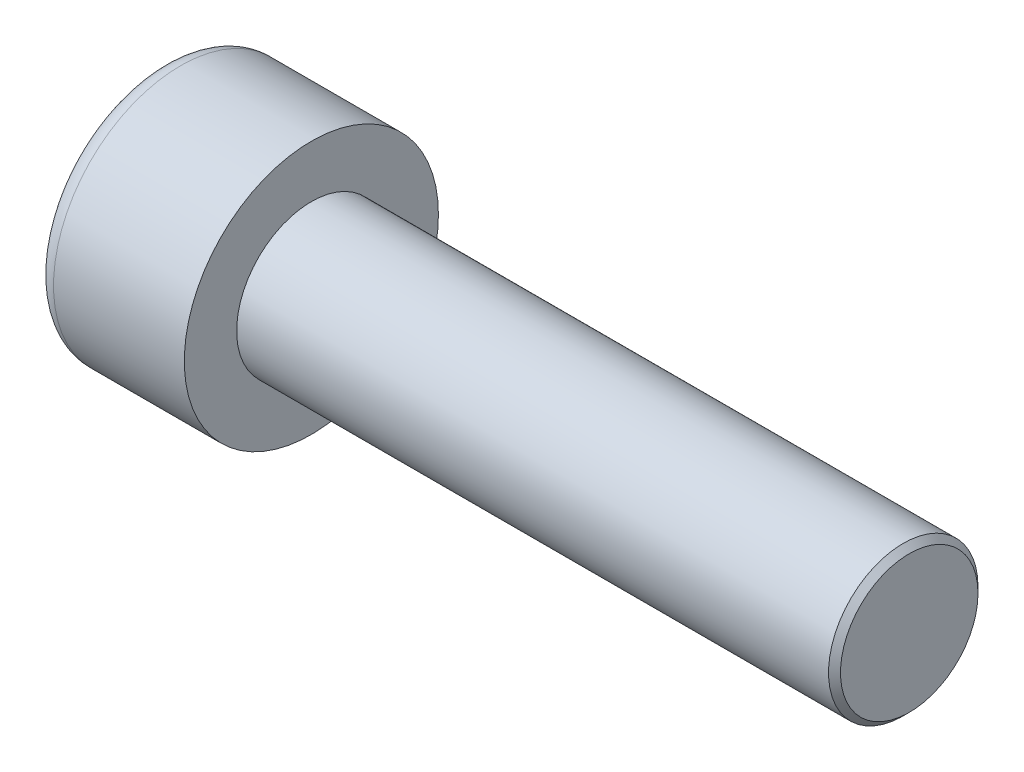
ISO-10303-21;
HEADER;
FILE_DESCRIPTION(('STEP AP214'),'2;1');
FILE_NAME('part.step','',(''),(''),'','','');
FILE_SCHEMA(('AUTOMOTIVE_DESIGN { 1 0 10303 214 1 1 1 1 }'));
ENDSEC;
DATA;
#1=APPLICATION_CONTEXT('core data for automotive mechanical design processes');
#2=APPLICATION_PROTOCOL_DEFINITION('international standard','automotive_design',2000,#1);
#3=PRODUCT_CONTEXT('',#1,'mechanical');
#4=PRODUCT('Part','Part','',(#3));
#5=PRODUCT_RELATED_PRODUCT_CATEGORY('part','',(#4));
#6=PRODUCT_DEFINITION_FORMATION('','',#4);
#7=PRODUCT_DEFINITION_CONTEXT('part definition',#1,'design');
#8=PRODUCT_DEFINITION('design','',#6,#7);
#9=PRODUCT_DEFINITION_SHAPE('','',#8);
#10=(LENGTH_UNIT() NAMED_UNIT(*) SI_UNIT(.MILLI.,.METRE.));
#11=(NAMED_UNIT(*) PLANE_ANGLE_UNIT() SI_UNIT($,.RADIAN.));
#12=(NAMED_UNIT(*) SI_UNIT($,.STERADIAN.) SOLID_ANGLE_UNIT());
#13=UNCERTAINTY_MEASURE_WITH_UNIT(LENGTH_MEASURE(1.E-05),#10,'distance_accuracy_value','');
#14=(GEOMETRIC_REPRESENTATION_CONTEXT(3) GLOBAL_UNCERTAINTY_ASSIGNED_CONTEXT((#13)) GLOBAL_UNIT_ASSIGNED_CONTEXT((#10,
#11,#12)) REPRESENTATION_CONTEXT('',''));
#15=CARTESIAN_POINT('',(0.,0.,0.));
#16=DIRECTION('',(0.,0.,1.));
#17=DIRECTION('',(1.,0.,0.));
#18=AXIS2_PLACEMENT_3D('',#15,#16,#17);
#19=CARTESIAN_POINT('',(2.5,0.,-2.3094010767585));
#20=DIRECTION('',(1.,0.,0.));
#21=DIRECTION('',(0.,0.,-1.));
#22=AXIS2_PLACEMENT_3D('',#19,#20,#21);
#23=PLANE('',#22);
#24=CARTESIAN_POINT('',(2.5,0.,0.));
#25=DIRECTION('',(1.,0.,0.));
#26=DIRECTION('',(0.,0.,-1.));
#27=AXIS2_PLACEMENT_3D('',#24,#25,#26);
#28=CIRCLE('',#27,2.);
#29=CARTESIAN_POINT('',(2.5,-1.,-1.73205080756888));
#30=VERTEX_POINT('',#29);
#31=CARTESIAN_POINT('',(2.5,-2.,0.));
#32=VERTEX_POINT('',#31);
#33=EDGE_CURVE('E160',#30,#32,#28,.F.);
#34=ORIENTED_EDGE('',*,*,#33,.F.);
#35=DIRECTION('',(0.,0.866025403784439,-0.5));
#36=VECTOR('',#35,1.);
#37=CARTESIAN_POINT('',(2.5,-2.,-1.15470053837925));
#38=LINE('',#37,#36);
#39=CARTESIAN_POINT('',(2.5,-2.,-1.15470053837925));
#40=VERTEX_POINT('',#39);
#41=EDGE_CURVE('E168',#40,#30,#38,.T.);
#42=ORIENTED_EDGE('',*,*,#41,.F.);
#43=DIRECTION('',(0.,0.,-1.));
#44=VECTOR('',#43,1.);
#45=CARTESIAN_POINT('',(2.5,-2.,1.15470053837925));
#46=LINE('',#45,#44);
#47=EDGE_CURVE('E185',#32,#40,#46,.T.);
#48=ORIENTED_EDGE('',*,*,#47,.F.);
#49=EDGE_LOOP('',(#34,#42,#48));
#50=FACE_BOUND('',#49,.T.);
#51=ADVANCED_FACE('F37',(#50),#23,.F.);
#52=CARTESIAN_POINT('',(2.5,-1.,1.73205080756888));
#53=VERTEX_POINT('',#52);
#54=EDGE_CURVE('E290',#32,#53,#28,.F.);
#55=ORIENTED_EDGE('',*,*,#54,.F.);
#56=CARTESIAN_POINT('',(2.5,-2.,1.15470053837925));
#57=VERTEX_POINT('',#56);
#58=EDGE_CURVE('E186',#57,#32,#46,.T.);
#59=ORIENTED_EDGE('',*,*,#58,.F.);
#60=DIRECTION('',(0.,-0.866025403784439,-0.5));
#61=VECTOR('',#60,1.);
#62=CARTESIAN_POINT('',(2.5,0.,2.3094010767585));
#63=LINE('',#62,#61);
#64=EDGE_CURVE('E181',#53,#57,#63,.T.);
#65=ORIENTED_EDGE('',*,*,#64,.F.);
#66=EDGE_LOOP('',(#55,#59,#65));
#67=FACE_BOUND('',#66,.T.);
#68=ADVANCED_FACE('F126',(#67),#23,.F.);
#69=CARTESIAN_POINT('',(2.5,1.,1.73205080756888));
#70=VERTEX_POINT('',#69);
#71=EDGE_CURVE('E286',#53,#70,#28,.F.);
#72=ORIENTED_EDGE('',*,*,#71,.F.);
#73=CARTESIAN_POINT('',(2.5,0.,2.3094010767585));
#74=VERTEX_POINT('',#73);
#75=EDGE_CURVE('E182',#74,#53,#63,.T.);
#76=ORIENTED_EDGE('',*,*,#75,.F.);
#77=DIRECTION('',(0.,-0.866025403784438,0.5));
#78=VECTOR('',#77,1.);
#79=CARTESIAN_POINT('',(2.5,2.,1.15470053837925));
#80=LINE('',#79,#78);
#81=EDGE_CURVE('E177',#70,#74,#80,.T.);
#82=ORIENTED_EDGE('',*,*,#81,.F.);
#83=EDGE_LOOP('',(#72,#76,#82));
#84=FACE_BOUND('',#83,.T.);
#85=ADVANCED_FACE('F132',(#84),#23,.F.);
#86=CARTESIAN_POINT('',(2.5,2.,0.));
#87=VERTEX_POINT('',#86);
#88=EDGE_CURVE('E157',#70,#87,#28,.F.);
#89=ORIENTED_EDGE('',*,*,#88,.F.);
#90=CARTESIAN_POINT('',(2.5,2.,1.15470053837925));
#91=VERTEX_POINT('',#90);
#92=EDGE_CURVE('E178',#91,#70,#80,.T.);
#93=ORIENTED_EDGE('',*,*,#92,.F.);
#94=DIRECTION('',(0.,0.,1.));
#95=VECTOR('',#94,1.);
#96=CARTESIAN_POINT('',(2.5,2.,-1.15470053837925));
#97=LINE('',#96,#95);
#98=EDGE_CURVE('E172',#87,#91,#97,.T.);
#99=ORIENTED_EDGE('',*,*,#98,.F.);
#100=EDGE_LOOP('',(#89,#93,#99));
#101=FACE_BOUND('',#100,.T.);
#102=ADVANCED_FACE('F146',(#101),#23,.F.);
#103=CARTESIAN_POINT('',(2.5,0.,0.));
#104=DIRECTION('',(1.,0.,0.));
#105=DIRECTION('',(0.,0.,-1.));
#106=AXIS2_PLACEMENT_3D('',#103,#104,#105);
#107=CIRCLE('',#106,2.);
#108=CARTESIAN_POINT('',(2.5,1.,-1.73205080756888));
#109=VERTEX_POINT('',#108);
#110=EDGE_CURVE('E52',#109,#87,#107,.T.);
#111=ORIENTED_EDGE('',*,*,#110,.T.);
#112=CARTESIAN_POINT('',(2.5,2.,-1.15470053837925));
#113=VERTEX_POINT('',#112);
#114=EDGE_CURVE('E165',#113,#87,#97,.T.);
#115=ORIENTED_EDGE('',*,*,#114,.F.);
#116=DIRECTION('',(0.,0.866025403784438,0.5));
#117=VECTOR('',#116,1.);
#118=CARTESIAN_POINT('',(2.5,0.,-2.3094010767585));
#119=LINE('',#118,#117);
#120=EDGE_CURVE('E162',#109,#113,#119,.T.);
#121=ORIENTED_EDGE('',*,*,#120,.F.);
#122=EDGE_LOOP('',(#111,#115,#121));
#123=FACE_BOUND('',#122,.T.);
#124=ADVANCED_FACE('F137',(#123),#23,.F.);
#125=EDGE_CURVE('E150',#109,#30,#28,.F.);
#126=ORIENTED_EDGE('',*,*,#125,.F.);
#127=CARTESIAN_POINT('',(2.5,0.,-2.3094010767585));
#128=VERTEX_POINT('',#127);
#129=EDGE_CURVE('E153',#128,#109,#119,.T.);
#130=ORIENTED_EDGE('',*,*,#129,.F.);
#131=EDGE_CURVE('E155',#30,#128,#38,.T.);
#132=ORIENTED_EDGE('',*,*,#131,.F.);
#133=EDGE_LOOP('',(#126,#130,#132));
#134=FACE_BOUND('',#133,.T.);
#135=ADVANCED_FACE('F128',(#134),#23,.F.);
#136=CARTESIAN_POINT('',(0.,0.,0.));
#137=DIRECTION('',(1.,0.,0.));
#138=DIRECTION('',(0.,0.,-1.));
#139=AXIS2_PLACEMENT_3D('',#136,#137,#138);
#140=PLANE('',#139);
#141=CARTESIAN_POINT('',(0.,0.,0.));
#142=DIRECTION('',(1.,0.,0.));
#143=DIRECTION('',(0.,0.,-1.));
#144=AXIS2_PLACEMENT_3D('',#141,#142,#143);
#145=CIRCLE('',#144,3.625);
#146=CARTESIAN_POINT('',(0.,0.,-3.625));
#147=VERTEX_POINT('',#146);
#148=EDGE_CURVE('E225',#147,#147,#145,.F.);
#149=ORIENTED_EDGE('',*,*,#148,.T.);
#150=EDGE_LOOP('',(#149));
#151=FACE_BOUND('',#150,.T.);
#152=DIRECTION('',(0.,0.866025403784439,-0.5));
#153=VECTOR('',#152,1.);
#154=CARTESIAN_POINT('',(0.,-2.,-1.15470053837925));
#155=LINE('',#154,#153);
#156=CARTESIAN_POINT('',(0.,-2.,-1.15470053837925));
#157=VERTEX_POINT('',#156);
#158=CARTESIAN_POINT('',(0.,0.,-2.3094010767585));
#159=VERTEX_POINT('',#158);
#160=EDGE_CURVE('E60',#157,#159,#155,.T.);
#161=ORIENTED_EDGE('',*,*,#160,.T.);
#162=DIRECTION('',(0.,0.866025403784438,0.5));
#163=VECTOR('',#162,1.);
#164=CARTESIAN_POINT('',(0.,0.,-2.3094010767585));
#165=LINE('',#164,#163);
#166=CARTESIAN_POINT('',(0.,2.,-1.15470053837925));
#167=VERTEX_POINT('',#166);
#168=EDGE_CURVE('E191',#159,#167,#165,.T.);
#169=ORIENTED_EDGE('',*,*,#168,.T.);
#170=DIRECTION('',(0.,0.,1.));
#171=VECTOR('',#170,1.);
#172=CARTESIAN_POINT('',(0.,2.,-1.15470053837925));
#173=LINE('',#172,#171);
#174=CARTESIAN_POINT('',(0.,2.,1.15470053837925));
#175=VERTEX_POINT('',#174);
#176=EDGE_CURVE('E194',#167,#175,#173,.T.);
#177=ORIENTED_EDGE('',*,*,#176,.T.);
#178=DIRECTION('',(0.,-0.866025403784438,0.5));
#179=VECTOR('',#178,1.);
#180=CARTESIAN_POINT('',(0.,2.,1.15470053837925));
#181=LINE('',#180,#179);
#182=CARTESIAN_POINT('',(0.,0.,2.3094010767585));
#183=VERTEX_POINT('',#182);
#184=EDGE_CURVE('E197',#175,#183,#181,.T.);
#185=ORIENTED_EDGE('',*,*,#184,.T.);
#186=DIRECTION('',(0.,-0.866025403784439,-0.5));
#187=VECTOR('',#186,1.);
#188=CARTESIAN_POINT('',(0.,0.,2.3094010767585));
#189=LINE('',#188,#187);
#190=CARTESIAN_POINT('',(0.,-2.,1.15470053837925));
#191=VERTEX_POINT('',#190);
#192=EDGE_CURVE('E200',#183,#191,#189,.T.);
#193=ORIENTED_EDGE('',*,*,#192,.T.);
#194=DIRECTION('',(0.,0.,-1.));
#195=VECTOR('',#194,1.);
#196=CARTESIAN_POINT('',(0.,-2.,1.15470053837925));
#197=LINE('',#196,#195);
#198=EDGE_CURVE('E203',#191,#157,#197,.T.);
#199=ORIENTED_EDGE('',*,*,#198,.T.);
#200=EDGE_LOOP('',(#161,#169,#177,#185,#193,#199));
#201=FACE_BOUND('',#200,.T.);
#202=ADVANCED_FACE('F136',(#151,#201),#140,.F.);
#203=CARTESIAN_POINT('',(5.,0.,0.));
#204=DIRECTION('',(1.,0.,0.));
#205=DIRECTION('',(0.,0.,-1.));
#206=AXIS2_PLACEMENT_3D('',#203,#204,#205);
#207=PLANE('',#206);
#208=CARTESIAN_POINT('',(5.,0.,0.));
#209=DIRECTION('',(1.,0.,0.));
#210=DIRECTION('',(0.,0.,-1.));
#211=AXIS2_PLACEMENT_3D('',#208,#209,#210);
#212=CIRCLE('',#211,4.25);
#213=CARTESIAN_POINT('',(5.,0.,-4.25));
#214=VERTEX_POINT('',#213);
#215=EDGE_CURVE('E158',#214,#214,#212,.T.);
#216=ORIENTED_EDGE('',*,*,#215,.T.);
#217=EDGE_LOOP('',(#216));
#218=FACE_BOUND('',#217,.T.);
#219=CARTESIAN_POINT('',(5.,0.,0.));
#220=DIRECTION('',(1.,0.,0.));
#221=DIRECTION('',(0.,0.,-1.));
#222=AXIS2_PLACEMENT_3D('',#219,#220,#221);
#223=CIRCLE('',#222,2.5);
#224=CARTESIAN_POINT('',(5.,0.,-2.5));
#225=VERTEX_POINT('',#224);
#226=EDGE_CURVE('E216',#225,#225,#223,.T.);
#227=ORIENTED_EDGE('',*,*,#226,.F.);
#228=EDGE_LOOP('',(#227));
#229=FACE_BOUND('',#228,.T.);
#230=ADVANCED_FACE('F143',(#218,#229),#207,.T.);
#231=CARTESIAN_POINT('',(5.,0.,0.));
#232=DIRECTION('',(-1.,0.,0.));
#233=DIRECTION('',(0.,0.,1.));
#234=AXIS2_PLACEMENT_3D('',#231,#232,#233);
#235=CYLINDRICAL_SURFACE('',#234,4.25);
#236=CARTESIAN_POINT('',(0.625,0.,0.));
#237=DIRECTION('',(1.,0.,0.));
#238=DIRECTION('',(0.,0.,-1.));
#239=AXIS2_PLACEMENT_3D('',#236,#237,#238);
#240=CIRCLE('',#239,4.25);
#241=CARTESIAN_POINT('',(0.625,0.,-4.25));
#242=VERTEX_POINT('',#241);
#243=EDGE_CURVE('E222',#242,#242,#240,.T.);
#244=ORIENTED_EDGE('',*,*,#243,.T.);
#245=EDGE_LOOP('',(#244));
#246=FACE_BOUND('',#245,.T.);
#247=ORIENTED_EDGE('',*,*,#215,.F.);
#248=EDGE_LOOP('',(#247));
#249=FACE_BOUND('',#248,.T.);
#250=ADVANCED_FACE('F241',(#246,#249),#235,.T.);
#251=CARTESIAN_POINT('',(25.,0.,0.));
#252=DIRECTION('',(-1.,0.,0.));
#253=DIRECTION('',(0.,0.,1.));
#254=AXIS2_PLACEMENT_3D('',#251,#252,#253);
#255=CYLINDRICAL_SURFACE('',#254,2.5);
#256=CARTESIAN_POINT('',(24.8,0.,0.));
#257=DIRECTION('',(1.,0.,0.));
#258=DIRECTION('',(0.,0.,-1.));
#259=AXIS2_PLACEMENT_3D('',#256,#257,#258);
#260=CIRCLE('',#259,2.5);
#261=CARTESIAN_POINT('',(24.8,0.,-2.5));
#262=VERTEX_POINT('',#261);
#263=EDGE_CURVE('E11',#262,#262,#260,.F.);
#264=ORIENTED_EDGE('',*,*,#263,.T.);
#265=EDGE_LOOP('',(#264));
#266=FACE_BOUND('',#265,.T.);
#267=ORIENTED_EDGE('',*,*,#226,.T.);
#268=EDGE_LOOP('',(#267));
#269=FACE_BOUND('',#268,.T.);
#270=ADVANCED_FACE('F238',(#266,#269),#255,.T.);
#271=CARTESIAN_POINT('',(25.,0.,0.));
#272=DIRECTION('',(1.,0.,0.));
#273=DIRECTION('',(0.,0.,-1.));
#274=AXIS2_PLACEMENT_3D('',#271,#272,#273);
#275=PLANE('',#274);
#276=CARTESIAN_POINT('',(25.,0.,0.));
#277=DIRECTION('',(1.,0.,0.));
#278=DIRECTION('',(0.,0.,-1.));
#279=AXIS2_PLACEMENT_3D('',#276,#277,#278);
#280=CIRCLE('',#279,2.3);
#281=CARTESIAN_POINT('',(25.,0.,-2.3));
#282=VERTEX_POINT('',#281);
#283=EDGE_CURVE('E45',#282,#282,#280,.T.);
#284=ORIENTED_EDGE('',*,*,#283,.T.);
#285=EDGE_LOOP('',(#284));
#286=FACE_BOUND('',#285,.T.);
#287=ADVANCED_FACE('F230',(#286),#275,.T.);
#288=CARTESIAN_POINT('',(2.5,-2.,-1.15470053837925));
#289=DIRECTION('',(0.,0.5,0.866025403784439));
#290=DIRECTION('',(0.,-0.866025403784439,0.5));
#291=AXIS2_PLACEMENT_3D('',#288,#289,#290);
#292=PLANE('',#291);
#293=ORIENTED_EDGE('',*,*,#160,.F.);
#294=DIRECTION('',(-1.,0.,0.));
#295=VECTOR('',#294,1.);
#296=CARTESIAN_POINT('',(2.5,-2.,-1.15470053837925));
#297=LINE('',#296,#295);
#298=EDGE_CURVE('E189',#40,#157,#297,.T.);
#299=ORIENTED_EDGE('',*,*,#298,.F.);
#300=ORIENTED_EDGE('',*,*,#41,.T.);
#301=ORIENTED_EDGE('',*,*,#131,.T.);
#302=DIRECTION('',(-1.,0.,0.));
#303=VECTOR('',#302,1.);
#304=CARTESIAN_POINT('',(2.5,0.,-2.3094010767585));
#305=LINE('',#304,#303);
#306=EDGE_CURVE('E171',#128,#159,#305,.T.);
#307=ORIENTED_EDGE('',*,*,#306,.T.);
#308=EDGE_LOOP('',(#293,#299,#300,#301,#307));
#309=FACE_BOUND('',#308,.T.);
#310=ADVANCED_FACE('F256',(#309),#292,.T.);
#311=CARTESIAN_POINT('',(2.5,0.,-2.3094010767585));
#312=DIRECTION('',(0.,-0.5,0.866025403784438));
#313=DIRECTION('',(0.,-0.866025403784438,-0.5));
#314=AXIS2_PLACEMENT_3D('',#311,#312,#313);
#315=PLANE('',#314);
#316=ORIENTED_EDGE('',*,*,#168,.F.);
#317=ORIENTED_EDGE('',*,*,#306,.F.);
#318=ORIENTED_EDGE('',*,*,#129,.T.);
#319=ORIENTED_EDGE('',*,*,#120,.T.);
#320=DIRECTION('',(-1.,0.,0.));
#321=VECTOR('',#320,1.);
#322=CARTESIAN_POINT('',(2.5,2.,-1.15470053837925));
#323=LINE('',#322,#321);
#324=EDGE_CURVE('E213',#113,#167,#323,.T.);
#325=ORIENTED_EDGE('',*,*,#324,.T.);
#326=EDGE_LOOP('',(#316,#317,#318,#319,#325));
#327=FACE_BOUND('',#326,.T.);
#328=ADVANCED_FACE('F170',(#327),#315,.T.);
#329=CARTESIAN_POINT('',(2.5,2.,-1.15470053837925));
#330=DIRECTION('',(0.,-1.,0.));
#331=DIRECTION('',(0.,0.,-1.));
#332=AXIS2_PLACEMENT_3D('',#329,#330,#331);
#333=PLANE('',#332);
#334=ORIENTED_EDGE('',*,*,#176,.F.);
#335=ORIENTED_EDGE('',*,*,#324,.F.);
#336=ORIENTED_EDGE('',*,*,#114,.T.);
#337=ORIENTED_EDGE('',*,*,#98,.T.);
#338=DIRECTION('',(-1.,0.,0.));
#339=VECTOR('',#338,1.);
#340=CARTESIAN_POINT('',(2.5,2.,1.15470053837925));
#341=LINE('',#340,#339);
#342=EDGE_CURVE('E211',#91,#175,#341,.T.);
#343=ORIENTED_EDGE('',*,*,#342,.T.);
#344=EDGE_LOOP('',(#334,#335,#336,#337,#343));
#345=FACE_BOUND('',#344,.T.);
#346=ADVANCED_FACE('F261',(#345),#333,.T.);
#347=CARTESIAN_POINT('',(2.5,2.,1.15470053837925));
#348=DIRECTION('',(0.,-0.5,-0.866025403784439));
#349=DIRECTION('',(0.,0.866025403784439,-0.5));
#350=AXIS2_PLACEMENT_3D('',#347,#348,#349);
#351=PLANE('',#350);
#352=ORIENTED_EDGE('',*,*,#184,.F.);
#353=ORIENTED_EDGE('',*,*,#342,.F.);
#354=ORIENTED_EDGE('',*,*,#92,.T.);
#355=ORIENTED_EDGE('',*,*,#81,.T.);
#356=DIRECTION('',(-1.,0.,0.));
#357=VECTOR('',#356,1.);
#358=CARTESIAN_POINT('',(2.5,0.,2.3094010767585));
#359=LINE('',#358,#357);
#360=EDGE_CURVE('E209',#74,#183,#359,.T.);
#361=ORIENTED_EDGE('',*,*,#360,.T.);
#362=EDGE_LOOP('',(#352,#353,#354,#355,#361));
#363=FACE_BOUND('',#362,.T.);
#364=ADVANCED_FACE('F264',(#363),#351,.T.);
#365=CARTESIAN_POINT('',(2.5,0.,2.3094010767585));
#366=DIRECTION('',(0.,0.5,-0.866025403784438));
#367=DIRECTION('',(0.,0.866025403784439,0.5));
#368=AXIS2_PLACEMENT_3D('',#365,#366,#367);
#369=PLANE('',#368);
#370=ORIENTED_EDGE('',*,*,#192,.F.);
#371=ORIENTED_EDGE('',*,*,#360,.F.);
#372=ORIENTED_EDGE('',*,*,#75,.T.);
#373=ORIENTED_EDGE('',*,*,#64,.T.);
#374=DIRECTION('',(-1.,0.,0.));
#375=VECTOR('',#374,1.);
#376=CARTESIAN_POINT('',(2.5,-2.,1.15470053837925));
#377=LINE('',#376,#375);
#378=EDGE_CURVE('E207',#57,#191,#377,.T.);
#379=ORIENTED_EDGE('',*,*,#378,.T.);
#380=EDGE_LOOP('',(#370,#371,#372,#373,#379));
#381=FACE_BOUND('',#380,.T.);
#382=ADVANCED_FACE('F121',(#381),#369,.T.);
#383=CARTESIAN_POINT('',(2.5,-2.,1.15470053837925));
#384=DIRECTION('',(0.,1.,0.));
#385=DIRECTION('',(0.,0.,1.));
#386=AXIS2_PLACEMENT_3D('',#383,#384,#385);
#387=PLANE('',#386);
#388=ORIENTED_EDGE('',*,*,#198,.F.);
#389=ORIENTED_EDGE('',*,*,#378,.F.);
#390=ORIENTED_EDGE('',*,*,#58,.T.);
#391=ORIENTED_EDGE('',*,*,#47,.T.);
#392=ORIENTED_EDGE('',*,*,#298,.T.);
#393=EDGE_LOOP('',(#388,#389,#390,#391,#392));
#394=FACE_BOUND('',#393,.T.);
#395=ADVANCED_FACE('F114',(#394),#387,.T.);
#396=CARTESIAN_POINT('',(2.5,0.,0.));
#397=DIRECTION('',(-1.,0.,0.));
#398=DIRECTION('',(0.,0.,1.));
#399=AXIS2_PLACEMENT_3D('',#396,#397,#398);
#400=CONICAL_SURFACE('',#399,2.,1.04719755119659);
#401=CARTESIAN_POINT('',(3.65470053837926,0.,0.));
#402=VERTEX_POINT('',#401);
#403=VERTEX_LOOP('',#402);
#404=FACE_BOUND('',#403,.T.);
#405=ORIENTED_EDGE('',*,*,#110,.F.);
#406=ORIENTED_EDGE('',*,*,#125,.T.);
#407=ORIENTED_EDGE('',*,*,#33,.T.);
#408=ORIENTED_EDGE('',*,*,#54,.T.);
#409=ORIENTED_EDGE('',*,*,#71,.T.);
#410=ORIENTED_EDGE('',*,*,#88,.T.);
#411=EDGE_LOOP('',(#405,#406,#407,#408,#409,#410));
#412=FACE_BOUND('',#411,.T.);
#413=ADVANCED_FACE('F111',(#404,#412),#400,.F.);
#414=CARTESIAN_POINT('',(0.625,0.,0.));
#415=DIRECTION('',(1.,0.,0.));
#416=DIRECTION('',(0.,0.,-1.));
#417=AXIS2_PLACEMENT_3D('',#414,#415,#416);
#418=TOROIDAL_SURFACE('',#417,3.625,0.625);
#419=ORIENTED_EDGE('',*,*,#148,.F.);
#420=EDGE_LOOP('',(#419));
#421=FACE_BOUND('',#420,.T.);
#422=ORIENTED_EDGE('',*,*,#243,.F.);
#423=EDGE_LOOP('',(#422));
#424=FACE_BOUND('',#423,.T.);
#425=ADVANCED_FACE('F113',(#421,#424),#418,.T.);
#426=CARTESIAN_POINT('',(25.,0.,0.));
#427=DIRECTION('',(-1.,0.,0.));
#428=DIRECTION('',(0.,0.,1.));
#429=AXIS2_PLACEMENT_3D('',#426,#427,#428);
#430=CONICAL_SURFACE('',#429,2.3,0.785398163397452);
#431=ORIENTED_EDGE('',*,*,#263,.F.);
#432=EDGE_LOOP('',(#431));
#433=FACE_BOUND('',#432,.T.);
#434=ORIENTED_EDGE('',*,*,#283,.F.);
#435=EDGE_LOOP('',(#434));
#436=FACE_BOUND('',#435,.T.);
#437=ADVANCED_FACE('F39',(#433,#436),#430,.T.);
#438=CLOSED_SHELL('',(#51,#68,#85,#102,#124,#135,#202,#230,#250,#270,#287,#310,#328,#346,#364,
#382,#395,#413,#425,#437));
#439=MANIFOLD_SOLID_BREP('B2',#438);
#440=ADVANCED_BREP_SHAPE_REPRESENTATION('',(#18,#439),#14);
#441=SHAPE_DEFINITION_REPRESENTATION(#9,#440);
ENDSEC;
END-ISO-10303-21;
